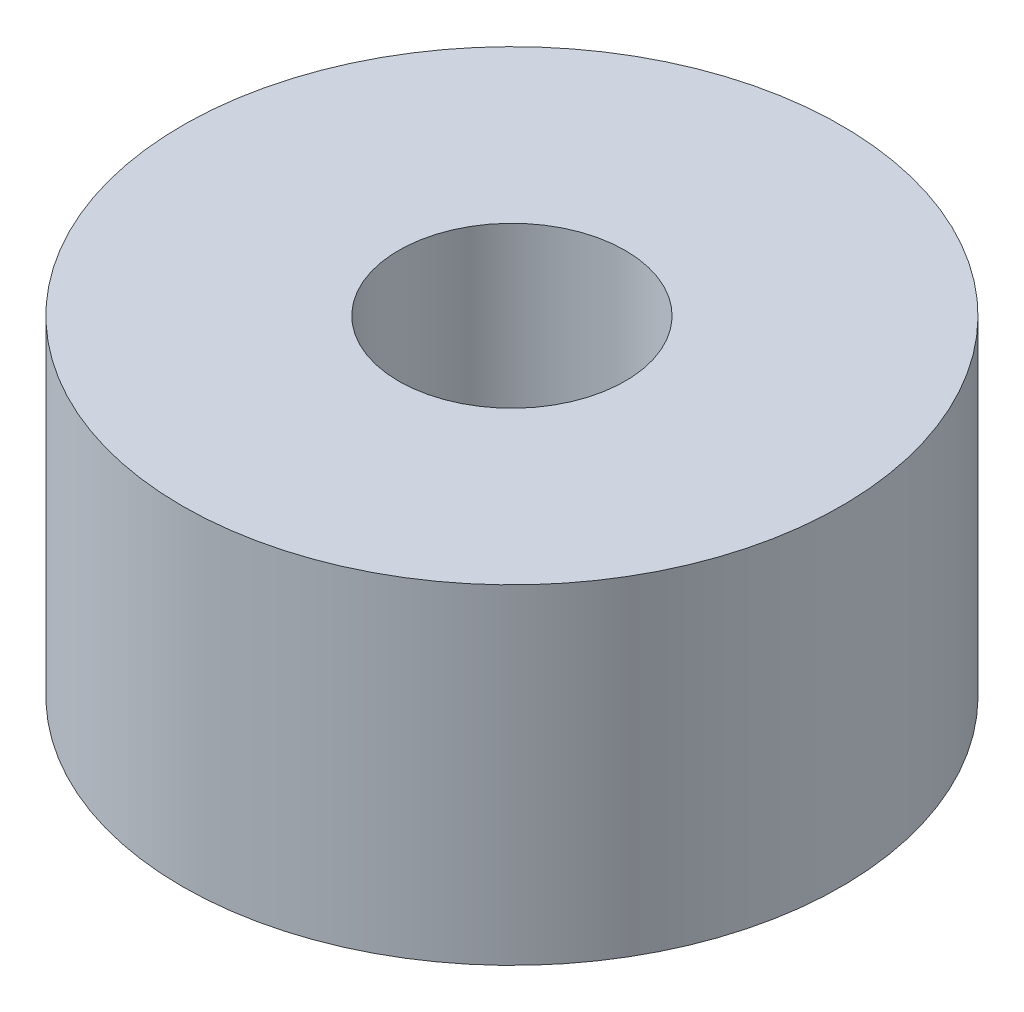
ISO-10303-21;
HEADER;
FILE_DESCRIPTION(('STEP AP214'),'2;1');
FILE_NAME('part.step','',(''),(''),'','','');
FILE_SCHEMA(('AUTOMOTIVE_DESIGN { 1 0 10303 214 1 1 1 1 }'));
ENDSEC;
DATA;
#1=APPLICATION_CONTEXT('core data for automotive mechanical design processes');
#2=APPLICATION_PROTOCOL_DEFINITION('international standard','automotive_design',2000,#1);
#3=PRODUCT_CONTEXT('',#1,'mechanical');
#4=PRODUCT('Part','Part','',(#3));
#5=PRODUCT_RELATED_PRODUCT_CATEGORY('part','',(#4));
#6=PRODUCT_DEFINITION_FORMATION('','',#4);
#7=PRODUCT_DEFINITION_CONTEXT('part definition',#1,'design');
#8=PRODUCT_DEFINITION('design','',#6,#7);
#9=PRODUCT_DEFINITION_SHAPE('','',#8);
#10=(LENGTH_UNIT() NAMED_UNIT(*) SI_UNIT(.MILLI.,.METRE.));
#11=(NAMED_UNIT(*) PLANE_ANGLE_UNIT() SI_UNIT($,.RADIAN.));
#12=(NAMED_UNIT(*) SI_UNIT($,.STERADIAN.) SOLID_ANGLE_UNIT());
#13=UNCERTAINTY_MEASURE_WITH_UNIT(LENGTH_MEASURE(1.E-05),#10,'distance_accuracy_value','');
#14=(GEOMETRIC_REPRESENTATION_CONTEXT(3) GLOBAL_UNCERTAINTY_ASSIGNED_CONTEXT((#13)) GLOBAL_UNIT_ASSIGNED_CONTEXT((#10,
#11,#12)) REPRESENTATION_CONTEXT('',''));
#15=CARTESIAN_POINT('',(0.,0.,0.));
#16=DIRECTION('',(0.,0.,1.));
#17=DIRECTION('',(1.,0.,0.));
#18=AXIS2_PLACEMENT_3D('',#15,#16,#17);
#19=CARTESIAN_POINT('',(0.,6.35,0.));
#20=DIRECTION('',(0.,1.,0.));
#21=DIRECTION('',(0.,0.,1.));
#22=AXIS2_PLACEMENT_3D('',#19,#20,#21);
#23=PLANE('',#22);
#24=CARTESIAN_POINT('',(0.,6.35,0.));
#25=DIRECTION('',(0.,1.,0.));
#26=DIRECTION('',(0.,0.,1.));
#27=AXIS2_PLACEMENT_3D('',#24,#25,#26);
#28=CIRCLE('',#27,6.35);
#29=CARTESIAN_POINT('',(0.,6.35,6.35));
#30=VERTEX_POINT('',#29);
#31=EDGE_CURVE('E10',#30,#30,#28,.T.);
#32=ORIENTED_EDGE('',*,*,#31,.T.);
#33=EDGE_LOOP('',(#32));
#34=FACE_BOUND('',#33,.T.);
#35=CARTESIAN_POINT('',(0.,6.35,0.));
#36=DIRECTION('',(0.,1.,0.));
#37=DIRECTION('',(0.,0.,1.));
#38=AXIS2_PLACEMENT_3D('',#35,#36,#37);
#39=CIRCLE('',#38,2.1828125);
#40=CARTESIAN_POINT('',(0.,6.35,2.1828125));
#41=VERTEX_POINT('',#40);
#42=EDGE_CURVE('E54',#41,#41,#39,.T.);
#43=ORIENTED_EDGE('',*,*,#42,.F.);
#44=EDGE_LOOP('',(#43));
#45=FACE_BOUND('',#44,.T.);
#46=ADVANCED_FACE('F41',(#34,#45),#23,.T.);
#47=CARTESIAN_POINT('',(0.,0.,0.));
#48=DIRECTION('',(0.,1.,0.));
#49=DIRECTION('',(0.,0.,1.));
#50=AXIS2_PLACEMENT_3D('',#47,#48,#49);
#51=PLANE('',#50);
#52=CARTESIAN_POINT('',(0.,0.,0.));
#53=DIRECTION('',(0.,1.,0.));
#54=DIRECTION('',(0.,0.,1.));
#55=AXIS2_PLACEMENT_3D('',#52,#53,#54);
#56=CIRCLE('',#55,6.35);
#57=CARTESIAN_POINT('',(0.,0.,6.35));
#58=VERTEX_POINT('',#57);
#59=EDGE_CURVE('E45',#58,#58,#56,.T.);
#60=ORIENTED_EDGE('',*,*,#59,.F.);
#61=EDGE_LOOP('',(#60));
#62=FACE_BOUND('',#61,.T.);
#63=CARTESIAN_POINT('',(0.,0.,0.));
#64=DIRECTION('',(0.,1.,0.));
#65=DIRECTION('',(0.,0.,1.));
#66=AXIS2_PLACEMENT_3D('',#63,#64,#65);
#67=CIRCLE('',#66,2.1828125);
#68=CARTESIAN_POINT('',(0.,0.,2.1828125));
#69=VERTEX_POINT('',#68);
#70=EDGE_CURVE('E56',#69,#69,#67,.T.);
#71=ORIENTED_EDGE('',*,*,#70,.T.);
#72=EDGE_LOOP('',(#71));
#73=FACE_BOUND('',#72,.T.);
#74=ADVANCED_FACE('F68',(#62,#73),#51,.F.);
#75=CARTESIAN_POINT('',(0.,6.35,0.));
#76=DIRECTION('',(0.,-1.,0.));
#77=DIRECTION('',(0.,0.,-1.));
#78=AXIS2_PLACEMENT_3D('',#75,#76,#77);
#79=CYLINDRICAL_SURFACE('',#78,6.35);
#80=ORIENTED_EDGE('',*,*,#31,.F.);
#81=EDGE_LOOP('',(#80));
#82=FACE_BOUND('',#81,.T.);
#83=ORIENTED_EDGE('',*,*,#59,.T.);
#84=EDGE_LOOP('',(#83));
#85=FACE_BOUND('',#84,.T.);
#86=ADVANCED_FACE('F43',(#82,#85),#79,.T.);
#87=CARTESIAN_POINT('',(0.,6.35,0.));
#88=DIRECTION('',(0.,-1.,0.));
#89=DIRECTION('',(0.,0.,-1.));
#90=AXIS2_PLACEMENT_3D('',#87,#88,#89);
#91=CYLINDRICAL_SURFACE('',#90,2.1828125);
#92=ORIENTED_EDGE('',*,*,#42,.T.);
#93=EDGE_LOOP('',(#92));
#94=FACE_BOUND('',#93,.T.);
#95=ORIENTED_EDGE('',*,*,#70,.F.);
#96=EDGE_LOOP('',(#95));
#97=FACE_BOUND('',#96,.T.);
#98=ADVANCED_FACE('F64',(#94,#97),#91,.F.);
#99=CLOSED_SHELL('',(#46,#74,#86,#98));
#100=MANIFOLD_SOLID_BREP('B2',#99);
#101=ADVANCED_BREP_SHAPE_REPRESENTATION('',(#18,#100),#14);
#102=SHAPE_DEFINITION_REPRESENTATION(#9,#101);
ENDSEC;
END-ISO-10303-21;
